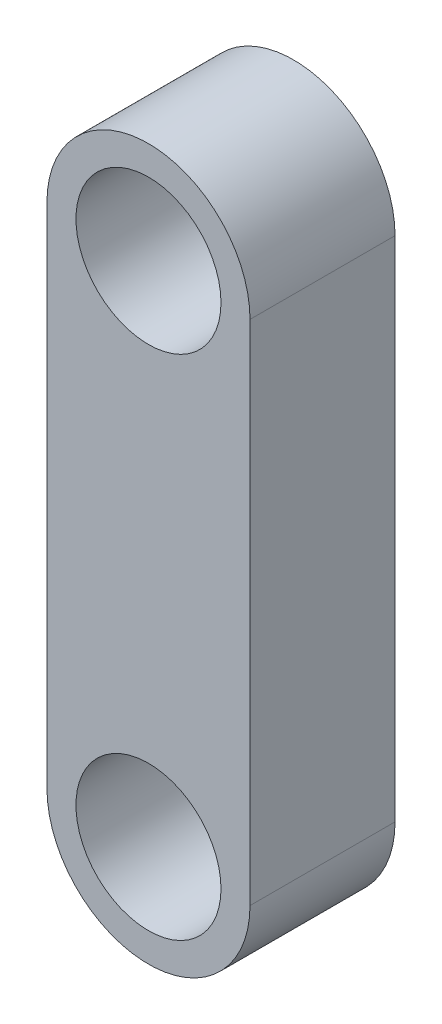
ISO-10303-21;
HEADER;
FILE_DESCRIPTION(('STEP AP214'),'2;1');
FILE_NAME('part.step','',(''),(''),'','','');
FILE_SCHEMA(('AUTOMOTIVE_DESIGN { 1 0 10303 214 1 1 1 1 }'));
ENDSEC;
DATA;
#1=APPLICATION_CONTEXT('core data for automotive mechanical design processes');
#2=APPLICATION_PROTOCOL_DEFINITION('international standard','automotive_design',2000,#1);
#3=PRODUCT_CONTEXT('',#1,'mechanical');
#4=PRODUCT('Part','Part','',(#3));
#5=PRODUCT_RELATED_PRODUCT_CATEGORY('part','',(#4));
#6=PRODUCT_DEFINITION_FORMATION('','',#4);
#7=PRODUCT_DEFINITION_CONTEXT('part definition',#1,'design');
#8=PRODUCT_DEFINITION('design','',#6,#7);
#9=PRODUCT_DEFINITION_SHAPE('','',#8);
#10=(LENGTH_UNIT() NAMED_UNIT(*) SI_UNIT(.MILLI.,.METRE.));
#11=(NAMED_UNIT(*) PLANE_ANGLE_UNIT() SI_UNIT($,.RADIAN.));
#12=(NAMED_UNIT(*) SI_UNIT($,.STERADIAN.) SOLID_ANGLE_UNIT());
#13=UNCERTAINTY_MEASURE_WITH_UNIT(LENGTH_MEASURE(1.E-05),#10,'distance_accuracy_value','');
#14=(GEOMETRIC_REPRESENTATION_CONTEXT(3) GLOBAL_UNCERTAINTY_ASSIGNED_CONTEXT((#13)) GLOBAL_UNIT_ASSIGNED_CONTEXT((#10,
#11,#12)) REPRESENTATION_CONTEXT('',''));
#15=CARTESIAN_POINT('',(0.,0.,0.));
#16=DIRECTION('',(0.,0.,1.));
#17=DIRECTION('',(1.,0.,0.));
#18=AXIS2_PLACEMENT_3D('',#15,#16,#17);
#19=CARTESIAN_POINT('',(0.,17.5,10.));
#20=DIRECTION('',(0.,0.,1.));
#21=DIRECTION('',(1.,0.,0.));
#22=AXIS2_PLACEMENT_3D('',#19,#20,#21);
#23=PLANE('',#22);
#24=CARTESIAN_POINT('',(0.,17.5,10.));
#25=DIRECTION('',(0.,0.,1.));
#26=DIRECTION('',(1.,0.,0.));
#27=AXIS2_PLACEMENT_3D('',#24,#25,#26);
#28=CIRCLE('',#27,5.);
#29=CARTESIAN_POINT('',(5.,17.5,10.));
#30=VERTEX_POINT('',#29);
#31=EDGE_CURVE('E104',#30,#30,#28,.T.);
#32=ORIENTED_EDGE('',*,*,#31,.F.);
#33=EDGE_LOOP('',(#32));
#34=FACE_BOUND('',#33,.T.);
#35=CARTESIAN_POINT('',(0.,17.5,10.));
#36=DIRECTION('',(0.,0.,1.));
#37=DIRECTION('',(1.,0.,0.));
#38=AXIS2_PLACEMENT_3D('',#35,#36,#37);
#39=CIRCLE('',#38,7.);
#40=CARTESIAN_POINT('',(7.,17.5,10.));
#41=VERTEX_POINT('',#40);
#42=CARTESIAN_POINT('',(-7.,17.5,10.));
#43=VERTEX_POINT('',#42);
#44=EDGE_CURVE('E89',#41,#43,#39,.T.);
#45=ORIENTED_EDGE('',*,*,#44,.T.);
#46=DIRECTION('',(0.,-1.,0.));
#47=VECTOR('',#46,1.);
#48=CARTESIAN_POINT('',(-7.,17.5,10.));
#49=LINE('',#48,#47);
#50=CARTESIAN_POINT('',(-7.,-17.5,10.));
#51=VERTEX_POINT('',#50);
#52=EDGE_CURVE('E84',#43,#51,#49,.T.);
#53=ORIENTED_EDGE('',*,*,#52,.T.);
#54=CARTESIAN_POINT('',(0.,-17.5,10.));
#55=DIRECTION('',(0.,0.,1.));
#56=DIRECTION('',(1.,0.,0.));
#57=AXIS2_PLACEMENT_3D('',#54,#55,#56);
#58=CIRCLE('',#57,7.);
#59=CARTESIAN_POINT('',(7.,-17.5,10.));
#60=VERTEX_POINT('',#59);
#61=EDGE_CURVE('E87',#51,#60,#58,.T.);
#62=ORIENTED_EDGE('',*,*,#61,.T.);
#63=DIRECTION('',(0.,1.,0.));
#64=VECTOR('',#63,1.);
#65=CARTESIAN_POINT('',(7.,17.5,10.));
#66=LINE('',#65,#64);
#67=EDGE_CURVE('E54',#60,#41,#66,.T.);
#68=ORIENTED_EDGE('',*,*,#67,.T.);
#69=EDGE_LOOP('',(#45,#53,#62,#68));
#70=FACE_BOUND('',#69,.T.);
#71=CARTESIAN_POINT('',(0.,-17.5,10.));
#72=DIRECTION('',(0.,0.,1.));
#73=DIRECTION('',(1.,0.,0.));
#74=AXIS2_PLACEMENT_3D('',#71,#72,#73);
#75=CIRCLE('',#74,5.);
#76=CARTESIAN_POINT('',(5.,-17.5,10.));
#77=VERTEX_POINT('',#76);
#78=EDGE_CURVE('E119',#77,#77,#75,.T.);
#79=ORIENTED_EDGE('',*,*,#78,.F.);
#80=EDGE_LOOP('',(#79));
#81=FACE_BOUND('',#80,.T.);
#82=ADVANCED_FACE('F37',(#34,#70,#81),#23,.T.);
#83=CARTESIAN_POINT('',(0.,17.5,0.));
#84=DIRECTION('',(0.,0.,1.));
#85=DIRECTION('',(1.,0.,0.));
#86=AXIS2_PLACEMENT_3D('',#83,#84,#85);
#87=PLANE('',#86);
#88=CARTESIAN_POINT('',(0.,17.5,0.));
#89=DIRECTION('',(0.,0.,1.));
#90=DIRECTION('',(1.,0.,0.));
#91=AXIS2_PLACEMENT_3D('',#88,#89,#90);
#92=CIRCLE('',#91,7.);
#93=CARTESIAN_POINT('',(7.,17.5,0.));
#94=VERTEX_POINT('',#93);
#95=CARTESIAN_POINT('',(-7.,17.5,0.));
#96=VERTEX_POINT('',#95);
#97=EDGE_CURVE('E101',#94,#96,#92,.T.);
#98=ORIENTED_EDGE('',*,*,#97,.F.);
#99=DIRECTION('',(0.,1.,0.));
#100=VECTOR('',#99,1.);
#101=CARTESIAN_POINT('',(7.,17.5,0.));
#102=LINE('',#101,#100);
#103=CARTESIAN_POINT('',(7.,-17.5,0.));
#104=VERTEX_POINT('',#103);
#105=EDGE_CURVE('E77',#104,#94,#102,.T.);
#106=ORIENTED_EDGE('',*,*,#105,.F.);
#107=CARTESIAN_POINT('',(0.,-17.5,0.));
#108=DIRECTION('',(0.,0.,1.));
#109=DIRECTION('',(1.,0.,0.));
#110=AXIS2_PLACEMENT_3D('',#107,#108,#109);
#111=CIRCLE('',#110,7.);
#112=CARTESIAN_POINT('',(-7.,-17.5,0.));
#113=VERTEX_POINT('',#112);
#114=EDGE_CURVE('E71',#113,#104,#111,.T.);
#115=ORIENTED_EDGE('',*,*,#114,.F.);
#116=DIRECTION('',(0.,-1.,0.));
#117=VECTOR('',#116,1.);
#118=CARTESIAN_POINT('',(-7.,17.5,0.));
#119=LINE('',#118,#117);
#120=EDGE_CURVE('E93',#96,#113,#119,.T.);
#121=ORIENTED_EDGE('',*,*,#120,.F.);
#122=EDGE_LOOP('',(#98,#106,#115,#121));
#123=FACE_BOUND('',#122,.T.);
#124=CARTESIAN_POINT('',(0.,17.5,0.));
#125=DIRECTION('',(0.,0.,1.));
#126=DIRECTION('',(1.,0.,0.));
#127=AXIS2_PLACEMENT_3D('',#124,#125,#126);
#128=CIRCLE('',#127,5.);
#129=CARTESIAN_POINT('',(5.,17.5,0.));
#130=VERTEX_POINT('',#129);
#131=EDGE_CURVE('E116',#130,#130,#128,.T.);
#132=ORIENTED_EDGE('',*,*,#131,.T.);
#133=EDGE_LOOP('',(#132));
#134=FACE_BOUND('',#133,.T.);
#135=CARTESIAN_POINT('',(0.,-17.5,0.));
#136=DIRECTION('',(0.,0.,1.));
#137=DIRECTION('',(1.,0.,0.));
#138=AXIS2_PLACEMENT_3D('',#135,#136,#137);
#139=CIRCLE('',#138,5.);
#140=CARTESIAN_POINT('',(5.,-17.5,0.));
#141=VERTEX_POINT('',#140);
#142=EDGE_CURVE('E122',#141,#141,#139,.T.);
#143=ORIENTED_EDGE('',*,*,#142,.T.);
#144=EDGE_LOOP('',(#143));
#145=FACE_BOUND('',#144,.T.);
#146=ADVANCED_FACE('F112',(#123,#134,#145),#87,.F.);
#147=CARTESIAN_POINT('',(0.,17.5,10.));
#148=DIRECTION('',(0.,0.,-1.));
#149=DIRECTION('',(-1.,0.,0.));
#150=AXIS2_PLACEMENT_3D('',#147,#148,#149);
#151=CYLINDRICAL_SURFACE('',#150,7.);
#152=ORIENTED_EDGE('',*,*,#97,.T.);
#153=DIRECTION('',(0.,0.,-1.));
#154=VECTOR('',#153,1.);
#155=CARTESIAN_POINT('',(-7.,17.5,10.));
#156=LINE('',#155,#154);
#157=EDGE_CURVE('E11',#43,#96,#156,.T.);
#158=ORIENTED_EDGE('',*,*,#157,.F.);
#159=ORIENTED_EDGE('',*,*,#44,.F.);
#160=DIRECTION('',(0.,0.,-1.));
#161=VECTOR('',#160,1.);
#162=CARTESIAN_POINT('',(7.,17.5,10.));
#163=LINE('',#162,#161);
#164=EDGE_CURVE('E97',#41,#94,#163,.T.);
#165=ORIENTED_EDGE('',*,*,#164,.T.);
#166=EDGE_LOOP('',(#152,#158,#159,#165));
#167=FACE_BOUND('',#166,.T.);
#168=ADVANCED_FACE('F39',(#167),#151,.T.);
#169=CARTESIAN_POINT('',(-7.,17.5,10.));
#170=DIRECTION('',(1.,0.,0.));
#171=DIRECTION('',(0.,1.,0.));
#172=AXIS2_PLACEMENT_3D('',#169,#170,#171);
#173=PLANE('',#172);
#174=ORIENTED_EDGE('',*,*,#120,.T.);
#175=DIRECTION('',(0.,0.,-1.));
#176=VECTOR('',#175,1.);
#177=CARTESIAN_POINT('',(-7.,-17.5,10.));
#178=LINE('',#177,#176);
#179=EDGE_CURVE('E46',#51,#113,#178,.T.);
#180=ORIENTED_EDGE('',*,*,#179,.F.);
#181=ORIENTED_EDGE('',*,*,#52,.F.);
#182=ORIENTED_EDGE('',*,*,#157,.T.);
#183=EDGE_LOOP('',(#174,#180,#181,#182));
#184=FACE_BOUND('',#183,.T.);
#185=ADVANCED_FACE('F92',(#184),#173,.F.);
#186=CARTESIAN_POINT('',(0.,-17.5,10.));
#187=DIRECTION('',(0.,0.,-1.));
#188=DIRECTION('',(-1.,0.,0.));
#189=AXIS2_PLACEMENT_3D('',#186,#187,#188);
#190=CYLINDRICAL_SURFACE('',#189,7.);
#191=ORIENTED_EDGE('',*,*,#114,.T.);
#192=DIRECTION('',(0.,0.,-1.));
#193=VECTOR('',#192,1.);
#194=CARTESIAN_POINT('',(7.,-17.5,10.));
#195=LINE('',#194,#193);
#196=EDGE_CURVE('E94',#60,#104,#195,.T.);
#197=ORIENTED_EDGE('',*,*,#196,.F.);
#198=ORIENTED_EDGE('',*,*,#61,.F.);
#199=ORIENTED_EDGE('',*,*,#179,.T.);
#200=EDGE_LOOP('',(#191,#197,#198,#199));
#201=FACE_BOUND('',#200,.T.);
#202=ADVANCED_FACE('F95',(#201),#190,.T.);
#203=CARTESIAN_POINT('',(7.,17.5,10.));
#204=DIRECTION('',(-1.,0.,0.));
#205=DIRECTION('',(0.,0.,1.));
#206=AXIS2_PLACEMENT_3D('',#203,#204,#205);
#207=PLANE('',#206);
#208=ORIENTED_EDGE('',*,*,#105,.T.);
#209=ORIENTED_EDGE('',*,*,#164,.F.);
#210=ORIENTED_EDGE('',*,*,#67,.F.);
#211=ORIENTED_EDGE('',*,*,#196,.T.);
#212=EDGE_LOOP('',(#208,#209,#210,#211));
#213=FACE_BOUND('',#212,.T.);
#214=ADVANCED_FACE('F109',(#213),#207,.F.);
#215=CARTESIAN_POINT('',(0.,17.5,10.));
#216=DIRECTION('',(0.,0.,-1.));
#217=DIRECTION('',(-1.,0.,0.));
#218=AXIS2_PLACEMENT_3D('',#215,#216,#217);
#219=CYLINDRICAL_SURFACE('',#218,5.);
#220=ORIENTED_EDGE('',*,*,#31,.T.);
#221=EDGE_LOOP('',(#220));
#222=FACE_BOUND('',#221,.T.);
#223=ORIENTED_EDGE('',*,*,#131,.F.);
#224=EDGE_LOOP('',(#223));
#225=FACE_BOUND('',#224,.T.);
#226=ADVANCED_FACE('F139',(#222,#225),#219,.F.);
#227=CARTESIAN_POINT('',(0.,-17.5,10.));
#228=DIRECTION('',(0.,0.,-1.));
#229=DIRECTION('',(-1.,0.,0.));
#230=AXIS2_PLACEMENT_3D('',#227,#228,#229);
#231=CYLINDRICAL_SURFACE('',#230,5.);
#232=ORIENTED_EDGE('',*,*,#78,.T.);
#233=EDGE_LOOP('',(#232));
#234=FACE_BOUND('',#233,.T.);
#235=ORIENTED_EDGE('',*,*,#142,.F.);
#236=EDGE_LOOP('',(#235));
#237=FACE_BOUND('',#236,.T.);
#238=ADVANCED_FACE('F128',(#234,#237),#231,.F.);
#239=CLOSED_SHELL('',(#82,#146,#168,#185,#202,#214,#226,#238));
#240=MANIFOLD_SOLID_BREP('B2',#239);
#241=ADVANCED_BREP_SHAPE_REPRESENTATION('',(#18,#240),#14);
#242=SHAPE_DEFINITION_REPRESENTATION(#9,#241);
ENDSEC;
END-ISO-10303-21;
